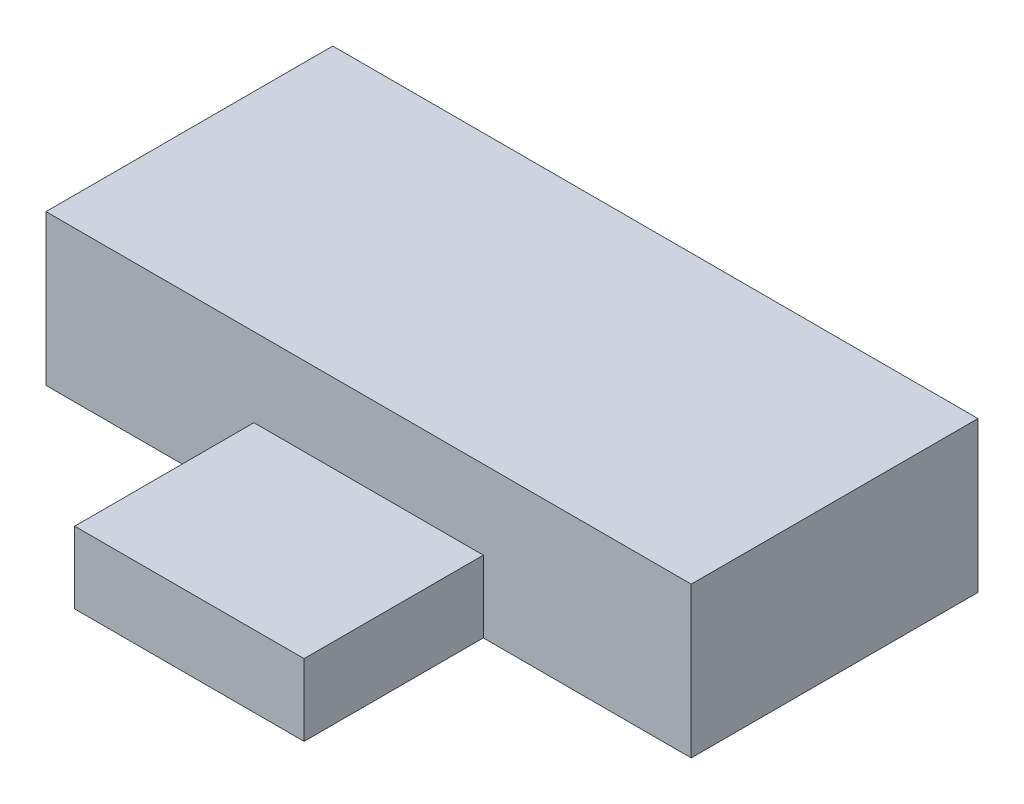
ISO-10303-21;
HEADER;
FILE_DESCRIPTION(('STEP AP214'),'2;1');
FILE_NAME('part.step','',(''),(''),'','','');
FILE_SCHEMA(('AUTOMOTIVE_DESIGN { 1 0 10303 214 1 1 1 1 }'));
ENDSEC;
DATA;
#1=APPLICATION_CONTEXT('core data for automotive mechanical design processes');
#2=APPLICATION_PROTOCOL_DEFINITION('international standard','automotive_design',2000,#1);
#3=PRODUCT_CONTEXT('',#1,'mechanical');
#4=PRODUCT('Part','Part','',(#3));
#5=PRODUCT_RELATED_PRODUCT_CATEGORY('part','',(#4));
#6=PRODUCT_DEFINITION_FORMATION('','',#4);
#7=PRODUCT_DEFINITION_CONTEXT('part definition',#1,'design');
#8=PRODUCT_DEFINITION('design','',#6,#7);
#9=PRODUCT_DEFINITION_SHAPE('','',#8);
#10=(LENGTH_UNIT() NAMED_UNIT(*) SI_UNIT(.MILLI.,.METRE.));
#11=(NAMED_UNIT(*) PLANE_ANGLE_UNIT() SI_UNIT($,.RADIAN.));
#12=(NAMED_UNIT(*) SI_UNIT($,.STERADIAN.) SOLID_ANGLE_UNIT());
#13=UNCERTAINTY_MEASURE_WITH_UNIT(LENGTH_MEASURE(1.E-05),#10,'distance_accuracy_value','');
#14=(GEOMETRIC_REPRESENTATION_CONTEXT(3) GLOBAL_UNCERTAINTY_ASSIGNED_CONTEXT((#13)) GLOBAL_UNIT_ASSIGNED_CONTEXT((#10,
#11,#12)) REPRESENTATION_CONTEXT('',''));
#15=CARTESIAN_POINT('',(0.,0.,0.));
#16=DIRECTION('',(0.,0.,1.));
#17=DIRECTION('',(1.,0.,0.));
#18=AXIS2_PLACEMENT_3D('',#15,#16,#17);
#19=CARTESIAN_POINT('',(-9.,4.2,4.));
#20=DIRECTION('',(0.,0.,-1.));
#21=DIRECTION('',(-1.,0.,0.));
#22=AXIS2_PLACEMENT_3D('',#19,#20,#21);
#23=PLANE('',#22);
#24=DIRECTION('',(0.,1.,0.));
#25=VECTOR('',#24,1.);
#26=CARTESIAN_POINT('',(3.2,2.,4.));
#27=LINE('',#26,#25);
#28=CARTESIAN_POINT('',(3.2,0.,4.));
#29=VERTEX_POINT('',#28);
#30=CARTESIAN_POINT('',(3.2,2.,4.));
#31=VERTEX_POINT('',#30);
#32=EDGE_CURVE('E55',#29,#31,#27,.T.);
#33=ORIENTED_EDGE('',*,*,#32,.F.);
#34=DIRECTION('',(1.,0.,0.));
#35=VECTOR('',#34,1.);
#36=CARTESIAN_POINT('',(-9.,0.,4.));
#37=LINE('',#36,#35);
#38=CARTESIAN_POINT('',(9.,0.,4.));
#39=VERTEX_POINT('',#38);
#40=EDGE_CURVE('E143',#29,#39,#37,.T.);
#41=ORIENTED_EDGE('',*,*,#40,.T.);
#42=DIRECTION('',(0.,-1.,0.));
#43=VECTOR('',#42,1.);
#44=CARTESIAN_POINT('',(9.,4.2,4.));
#45=LINE('',#44,#43);
#46=CARTESIAN_POINT('',(9.,4.2,4.));
#47=VERTEX_POINT('',#46);
#48=EDGE_CURVE('E138',#47,#39,#45,.T.);
#49=ORIENTED_EDGE('',*,*,#48,.F.);
#50=DIRECTION('',(1.,0.,0.));
#51=VECTOR('',#50,1.);
#52=CARTESIAN_POINT('',(-9.,4.2,4.));
#53=LINE('',#52,#51);
#54=CARTESIAN_POINT('',(-9.,4.2,4.));
#55=VERTEX_POINT('',#54);
#56=EDGE_CURVE('E137',#55,#47,#53,.T.);
#57=ORIENTED_EDGE('',*,*,#56,.F.);
#58=DIRECTION('',(0.,-1.,0.));
#59=VECTOR('',#58,1.);
#60=CARTESIAN_POINT('',(-9.,4.2,4.));
#61=LINE('',#60,#59);
#62=CARTESIAN_POINT('',(-9.,0.,4.));
#63=VERTEX_POINT('',#62);
#64=EDGE_CURVE('E153',#55,#63,#61,.T.);
#65=ORIENTED_EDGE('',*,*,#64,.T.);
#66=CARTESIAN_POINT('',(-3.2,0.,4.));
#67=VERTEX_POINT('',#66);
#68=EDGE_CURVE('E133',#63,#67,#37,.T.);
#69=ORIENTED_EDGE('',*,*,#68,.T.);
#70=DIRECTION('',(0.,-1.,0.));
#71=VECTOR('',#70,1.);
#72=CARTESIAN_POINT('',(-3.2,2.,4.));
#73=LINE('',#72,#71);
#74=CARTESIAN_POINT('',(-3.2,2.,4.));
#75=VERTEX_POINT('',#74);
#76=EDGE_CURVE('E117',#75,#67,#73,.T.);
#77=ORIENTED_EDGE('',*,*,#76,.F.);
#78=DIRECTION('',(-1.,0.,0.));
#79=VECTOR('',#78,1.);
#80=CARTESIAN_POINT('',(-3.2,2.,4.));
#81=LINE('',#80,#79);
#82=EDGE_CURVE('E50',#31,#75,#81,.T.);
#83=ORIENTED_EDGE('',*,*,#82,.F.);
#84=EDGE_LOOP('',(#33,#41,#49,#57,#65,#69,#77,#83));
#85=FACE_BOUND('',#84,.T.);
#86=ADVANCED_FACE('F33',(#85),#23,.F.);
#87=CARTESIAN_POINT('',(9.,4.2,-4.));
#88=DIRECTION('',(-1.,0.,0.));
#89=DIRECTION('',(0.,0.,1.));
#90=AXIS2_PLACEMENT_3D('',#87,#88,#89);
#91=PLANE('',#90);
#92=DIRECTION('',(0.,0.,-1.));
#93=VECTOR('',#92,1.);
#94=CARTESIAN_POINT('',(9.,0.,-4.));
#95=LINE('',#94,#93);
#96=CARTESIAN_POINT('',(9.,0.,-4.));
#97=VERTEX_POINT('',#96);
#98=EDGE_CURVE('E120',#39,#97,#95,.T.);
#99=ORIENTED_EDGE('',*,*,#98,.T.);
#100=DIRECTION('',(0.,-1.,0.));
#101=VECTOR('',#100,1.);
#102=CARTESIAN_POINT('',(9.,4.2,-4.));
#103=LINE('',#102,#101);
#104=CARTESIAN_POINT('',(9.,4.2,-4.));
#105=VERTEX_POINT('',#104);
#106=EDGE_CURVE('E11',#105,#97,#103,.T.);
#107=ORIENTED_EDGE('',*,*,#106,.F.);
#108=DIRECTION('',(0.,0.,-1.));
#109=VECTOR('',#108,1.);
#110=CARTESIAN_POINT('',(9.,4.2,-4.));
#111=LINE('',#110,#109);
#112=EDGE_CURVE('E129',#47,#105,#111,.T.);
#113=ORIENTED_EDGE('',*,*,#112,.F.);
#114=ORIENTED_EDGE('',*,*,#48,.T.);
#115=EDGE_LOOP('',(#99,#107,#113,#114));
#116=FACE_BOUND('',#115,.T.);
#117=ADVANCED_FACE('F35',(#116),#91,.F.);
#118=CARTESIAN_POINT('',(-9.,4.2,-4.));
#119=DIRECTION('',(0.,0.,1.));
#120=DIRECTION('',(1.,0.,0.));
#121=AXIS2_PLACEMENT_3D('',#118,#119,#120);
#122=PLANE('',#121);
#123=DIRECTION('',(-1.,0.,0.));
#124=VECTOR('',#123,1.);
#125=CARTESIAN_POINT('',(-9.,0.,-4.));
#126=LINE('',#125,#124);
#127=CARTESIAN_POINT('',(-9.,0.,-4.));
#128=VERTEX_POINT('',#127);
#129=EDGE_CURVE('E123',#97,#128,#126,.T.);
#130=ORIENTED_EDGE('',*,*,#129,.T.);
#131=DIRECTION('',(0.,-1.,0.));
#132=VECTOR('',#131,1.);
#133=CARTESIAN_POINT('',(-9.,4.2,-4.));
#134=LINE('',#133,#132);
#135=CARTESIAN_POINT('',(-9.,4.2,-4.));
#136=VERTEX_POINT('',#135);
#137=EDGE_CURVE('E42',#136,#128,#134,.T.);
#138=ORIENTED_EDGE('',*,*,#137,.F.);
#139=DIRECTION('',(-1.,0.,0.));
#140=VECTOR('',#139,1.);
#141=CARTESIAN_POINT('',(-9.,4.2,-4.));
#142=LINE('',#141,#140);
#143=EDGE_CURVE('E132',#105,#136,#142,.T.);
#144=ORIENTED_EDGE('',*,*,#143,.F.);
#145=ORIENTED_EDGE('',*,*,#106,.T.);
#146=EDGE_LOOP('',(#130,#138,#144,#145));
#147=FACE_BOUND('',#146,.T.);
#148=ADVANCED_FACE('F169',(#147),#122,.F.);
#149=CARTESIAN_POINT('',(-9.,4.2,-4.));
#150=DIRECTION('',(1.,0.,0.));
#151=DIRECTION('',(0.,0.,-1.));
#152=AXIS2_PLACEMENT_3D('',#149,#150,#151);
#153=PLANE('',#152);
#154=DIRECTION('',(0.,0.,1.));
#155=VECTOR('',#154,1.);
#156=CARTESIAN_POINT('',(-9.,0.,-4.));
#157=LINE('',#156,#155);
#158=EDGE_CURVE('E141',#128,#63,#157,.T.);
#159=ORIENTED_EDGE('',*,*,#158,.T.);
#160=ORIENTED_EDGE('',*,*,#64,.F.);
#161=DIRECTION('',(0.,0.,1.));
#162=VECTOR('',#161,1.);
#163=CARTESIAN_POINT('',(-9.,4.2,-4.));
#164=LINE('',#163,#162);
#165=EDGE_CURVE('E135',#136,#55,#164,.T.);
#166=ORIENTED_EDGE('',*,*,#165,.F.);
#167=ORIENTED_EDGE('',*,*,#137,.T.);
#168=EDGE_LOOP('',(#159,#160,#166,#167));
#169=FACE_BOUND('',#168,.T.);
#170=ADVANCED_FACE('F181',(#169),#153,.F.);
#171=CARTESIAN_POINT('',(0.,4.2,0.));
#172=DIRECTION('',(0.,1.,0.));
#173=DIRECTION('',(0.,0.,1.));
#174=AXIS2_PLACEMENT_3D('',#171,#172,#173);
#175=PLANE('',#174);
#176=ORIENTED_EDGE('',*,*,#112,.T.);
#177=ORIENTED_EDGE('',*,*,#143,.T.);
#178=ORIENTED_EDGE('',*,*,#165,.T.);
#179=ORIENTED_EDGE('',*,*,#56,.T.);
#180=EDGE_LOOP('',(#176,#177,#178,#179));
#181=FACE_BOUND('',#180,.T.);
#182=ADVANCED_FACE('F172',(#181),#175,.T.);
#183=CARTESIAN_POINT('',(0.,0.,0.));
#184=DIRECTION('',(0.,1.,0.));
#185=DIRECTION('',(0.,0.,1.));
#186=AXIS2_PLACEMENT_3D('',#183,#184,#185);
#187=PLANE('',#186);
#188=ORIENTED_EDGE('',*,*,#98,.F.);
#189=ORIENTED_EDGE('',*,*,#40,.F.);
#190=DIRECTION('',(0.,0.,-1.));
#191=VECTOR('',#190,1.);
#192=CARTESIAN_POINT('',(3.2,0.,9.));
#193=LINE('',#192,#191);
#194=CARTESIAN_POINT('',(3.2,0.,9.));
#195=VERTEX_POINT('',#194);
#196=EDGE_CURVE('E262',#195,#29,#193,.T.);
#197=ORIENTED_EDGE('',*,*,#196,.F.);
#198=DIRECTION('',(1.,0.,0.));
#199=VECTOR('',#198,1.);
#200=CARTESIAN_POINT('',(-3.2,0.,9.));
#201=LINE('',#200,#199);
#202=CARTESIAN_POINT('',(-3.2,0.,9.));
#203=VERTEX_POINT('',#202);
#204=EDGE_CURVE('E113',#203,#195,#201,.T.);
#205=ORIENTED_EDGE('',*,*,#204,.F.);
#206=DIRECTION('',(0.,0.,-1.));
#207=VECTOR('',#206,1.);
#208=CARTESIAN_POINT('',(-3.2,0.,9.));
#209=LINE('',#208,#207);
#210=EDGE_CURVE('E125',#203,#67,#209,.T.);
#211=ORIENTED_EDGE('',*,*,#210,.T.);
#212=ORIENTED_EDGE('',*,*,#68,.F.);
#213=ORIENTED_EDGE('',*,*,#158,.F.);
#214=ORIENTED_EDGE('',*,*,#129,.F.);
#215=EDGE_LOOP('',(#188,#189,#197,#205,#211,#212,#213,#214));
#216=FACE_BOUND('',#215,.T.);
#217=ADVANCED_FACE('F165',(#216),#187,.F.);
#218=CARTESIAN_POINT('',(3.2,2.,9.));
#219=DIRECTION('',(-1.,0.,0.));
#220=DIRECTION('',(0.,-1.,0.));
#221=AXIS2_PLACEMENT_3D('',#218,#219,#220);
#222=PLANE('',#221);
#223=ORIENTED_EDGE('',*,*,#32,.T.);
#224=DIRECTION('',(0.,0.,-1.));
#225=VECTOR('',#224,1.);
#226=CARTESIAN_POINT('',(3.2,2.,9.));
#227=LINE('',#226,#225);
#228=CARTESIAN_POINT('',(3.2,2.,9.));
#229=VERTEX_POINT('',#228);
#230=EDGE_CURVE('E102',#229,#31,#227,.T.);
#231=ORIENTED_EDGE('',*,*,#230,.F.);
#232=DIRECTION('',(0.,1.,0.));
#233=VECTOR('',#232,1.);
#234=CARTESIAN_POINT('',(3.2,2.,9.));
#235=LINE('',#234,#233);
#236=EDGE_CURVE('E108',#195,#229,#235,.T.);
#237=ORIENTED_EDGE('',*,*,#236,.F.);
#238=ORIENTED_EDGE('',*,*,#196,.T.);
#239=EDGE_LOOP('',(#223,#231,#237,#238));
#240=FACE_BOUND('',#239,.T.);
#241=ADVANCED_FACE('F119',(#240),#222,.F.);
#242=CARTESIAN_POINT('',(-3.2,2.,9.));
#243=DIRECTION('',(0.,-1.,0.));
#244=DIRECTION('',(0.,0.,-1.));
#245=AXIS2_PLACEMENT_3D('',#242,#243,#244);
#246=PLANE('',#245);
#247=ORIENTED_EDGE('',*,*,#82,.T.);
#248=DIRECTION('',(0.,0.,-1.));
#249=VECTOR('',#248,1.);
#250=CARTESIAN_POINT('',(-3.2,2.,9.));
#251=LINE('',#250,#249);
#252=CARTESIAN_POINT('',(-3.2,2.,9.));
#253=VERTEX_POINT('',#252);
#254=EDGE_CURVE('E104',#253,#75,#251,.T.);
#255=ORIENTED_EDGE('',*,*,#254,.F.);
#256=DIRECTION('',(-1.,0.,0.));
#257=VECTOR('',#256,1.);
#258=CARTESIAN_POINT('',(-3.2,2.,9.));
#259=LINE('',#258,#257);
#260=EDGE_CURVE('E98',#229,#253,#259,.T.);
#261=ORIENTED_EDGE('',*,*,#260,.F.);
#262=ORIENTED_EDGE('',*,*,#230,.T.);
#263=EDGE_LOOP('',(#247,#255,#261,#262));
#264=FACE_BOUND('',#263,.T.);
#265=ADVANCED_FACE('F100',(#264),#246,.F.);
#266=CARTESIAN_POINT('',(-3.2,2.,9.));
#267=DIRECTION('',(1.,0.,0.));
#268=DIRECTION('',(0.,1.,0.));
#269=AXIS2_PLACEMENT_3D('',#266,#267,#268);
#270=PLANE('',#269);
#271=ORIENTED_EDGE('',*,*,#76,.T.);
#272=ORIENTED_EDGE('',*,*,#210,.F.);
#273=DIRECTION('',(0.,-1.,0.));
#274=VECTOR('',#273,1.);
#275=CARTESIAN_POINT('',(-3.2,2.,9.));
#276=LINE('',#275,#274);
#277=EDGE_CURVE('E107',#253,#203,#276,.T.);
#278=ORIENTED_EDGE('',*,*,#277,.F.);
#279=ORIENTED_EDGE('',*,*,#254,.T.);
#280=EDGE_LOOP('',(#271,#272,#278,#279));
#281=FACE_BOUND('',#280,.T.);
#282=ADVANCED_FACE('F215',(#281),#270,.F.);
#283=CARTESIAN_POINT('',(0.,0.,9.));
#284=DIRECTION('',(0.,0.,1.));
#285=DIRECTION('',(1.,0.,0.));
#286=AXIS2_PLACEMENT_3D('',#283,#284,#285);
#287=PLANE('',#286);
#288=ORIENTED_EDGE('',*,*,#236,.T.);
#289=ORIENTED_EDGE('',*,*,#260,.T.);
#290=ORIENTED_EDGE('',*,*,#277,.T.);
#291=ORIENTED_EDGE('',*,*,#204,.T.);
#292=EDGE_LOOP('',(#288,#289,#290,#291));
#293=FACE_BOUND('',#292,.T.);
#294=ADVANCED_FACE('F111',(#293),#287,.T.);
#295=CLOSED_SHELL('',(#86,#117,#148,#170,#182,#217,#241,#265,#282,#294));
#296=MANIFOLD_SOLID_BREP('B2',#295);
#297=ADVANCED_BREP_SHAPE_REPRESENTATION('',(#18,#296),#14);
#298=SHAPE_DEFINITION_REPRESENTATION(#9,#297);
ENDSEC;
END-ISO-10303-21;
